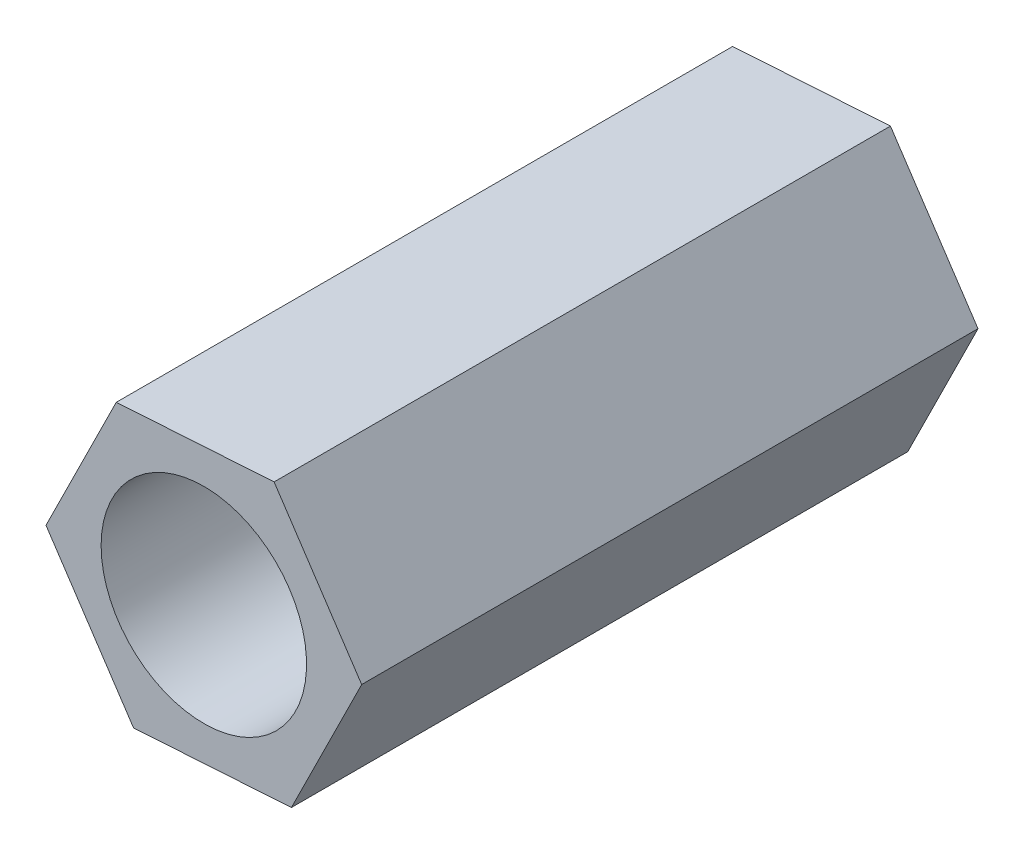
ISO-10303-21;
HEADER;
FILE_DESCRIPTION(('STEP AP214'),'2;1');
FILE_NAME('part.step','',(''),(''),'','','');
FILE_SCHEMA(('AUTOMOTIVE_DESIGN { 1 0 10303 214 1 1 1 1 }'));
ENDSEC;
DATA;
#1=APPLICATION_CONTEXT('core data for automotive mechanical design processes');
#2=APPLICATION_PROTOCOL_DEFINITION('international standard','automotive_design',2000,#1);
#3=PRODUCT_CONTEXT('',#1,'mechanical');
#4=PRODUCT('Part','Part','',(#3));
#5=PRODUCT_RELATED_PRODUCT_CATEGORY('part','',(#4));
#6=PRODUCT_DEFINITION_FORMATION('','',#4);
#7=PRODUCT_DEFINITION_CONTEXT('part definition',#1,'design');
#8=PRODUCT_DEFINITION('design','',#6,#7);
#9=PRODUCT_DEFINITION_SHAPE('','',#8);
#10=(LENGTH_UNIT() NAMED_UNIT(*) SI_UNIT(.MILLI.,.METRE.));
#11=(NAMED_UNIT(*) PLANE_ANGLE_UNIT() SI_UNIT($,.RADIAN.));
#12=(NAMED_UNIT(*) SI_UNIT($,.STERADIAN.) SOLID_ANGLE_UNIT());
#13=UNCERTAINTY_MEASURE_WITH_UNIT(LENGTH_MEASURE(1.E-05),#10,'distance_accuracy_value','');
#14=(GEOMETRIC_REPRESENTATION_CONTEXT(3) GLOBAL_UNCERTAINTY_ASSIGNED_CONTEXT((#13)) GLOBAL_UNIT_ASSIGNED_CONTEXT((#10,
#11,#12)) REPRESENTATION_CONTEXT('',''));
#15=CARTESIAN_POINT('',(0.,0.,0.));
#16=DIRECTION('',(0.,0.,1.));
#17=DIRECTION('',(1.,0.,0.));
#18=AXIS2_PLACEMENT_3D('',#15,#16,#17);
#19=CARTESIAN_POINT('',(2.30480420030551,0.14563973217298,9.));
#20=DIRECTION('',(-0.832769648149025,-0.55361964661828,0.));
#21=DIRECTION('',(0.55361964661828,-0.832769648149025,0.));
#22=AXIS2_PLACEMENT_3D('',#19,#20,#21);
#23=PLANE('',#22);
#24=DIRECTION('',(-0.55361964661828,0.832769648149025,0.));
#25=VECTOR('',#24,1.);
#26=CARTESIAN_POINT('',(2.30480420030551,0.14563973217298,0.));
#27=LINE('',#26,#25);
#28=CARTESIAN_POINT('',(2.30480420030551,0.14563973217298,0.));
#29=VERTEX_POINT('',#28);
#30=CARTESIAN_POINT('',(1.02627439229059,2.06883885430014,0.));
#31=VERTEX_POINT('',#30);
#32=EDGE_CURVE('E128',#29,#31,#27,.T.);
#33=ORIENTED_EDGE('',*,*,#32,.T.);
#34=DIRECTION('',(0.,0.,-1.));
#35=VECTOR('',#34,1.);
#36=CARTESIAN_POINT('',(1.02627439229059,2.06883885430014,9.));
#37=LINE('',#36,#35);
#38=CARTESIAN_POINT('',(1.02627439229059,2.06883885430014,9.));
#39=VERTEX_POINT('',#38);
#40=EDGE_CURVE('E11',#39,#31,#37,.T.);
#41=ORIENTED_EDGE('',*,*,#40,.F.);
#42=DIRECTION('',(-0.55361964661828,0.832769648149025,0.));
#43=VECTOR('',#42,1.);
#44=CARTESIAN_POINT('',(2.30480420030551,0.14563973217298,9.));
#45=LINE('',#44,#43);
#46=CARTESIAN_POINT('',(2.30480420030551,0.14563973217298,9.));
#47=VERTEX_POINT('',#46);
#48=EDGE_CURVE('E145',#47,#39,#45,.T.);
#49=ORIENTED_EDGE('',*,*,#48,.F.);
#50=DIRECTION('',(0.,0.,-1.));
#51=VECTOR('',#50,1.);
#52=CARTESIAN_POINT('',(2.30480420030551,0.14563973217298,9.));
#53=LINE('',#52,#51);
#54=EDGE_CURVE('E124',#47,#29,#53,.T.);
#55=ORIENTED_EDGE('',*,*,#54,.T.);
#56=EDGE_LOOP('',(#33,#41,#49,#55));
#57=FACE_BOUND('',#56,.T.);
#58=ADVANCED_FACE('F39',(#57),#23,.F.);
#59=CARTESIAN_POINT('',(1.02627439229059,2.06883885430014,9.));
#60=DIRECTION('',(0.0630638539310811,-0.998009494106824,0.));
#61=DIRECTION('',(0.998009494106824,0.0630638539310811,0.));
#62=AXIS2_PLACEMENT_3D('',#59,#60,#61);
#63=PLANE('',#62);
#64=DIRECTION('',(-0.998009494106824,-0.0630638539310811,0.));
#65=VECTOR('',#64,1.);
#66=CARTESIAN_POINT('',(1.02627439229059,2.06883885430014,0.));
#67=LINE('',#66,#65);
#68=CARTESIAN_POINT('',(-1.27852980801492,1.92319912212716,0.));
#69=VERTEX_POINT('',#68);
#70=EDGE_CURVE('E132',#31,#69,#67,.T.);
#71=ORIENTED_EDGE('',*,*,#70,.T.);
#72=DIRECTION('',(0.,0.,-1.));
#73=VECTOR('',#72,1.);
#74=CARTESIAN_POINT('',(-1.27852980801492,1.92319912212716,9.));
#75=LINE('',#74,#73);
#76=CARTESIAN_POINT('',(-1.27852980801492,1.92319912212716,9.));
#77=VERTEX_POINT('',#76);
#78=EDGE_CURVE('E48',#77,#69,#75,.T.);
#79=ORIENTED_EDGE('',*,*,#78,.F.);
#80=DIRECTION('',(-0.998009494106824,-0.0630638539310811,0.));
#81=VECTOR('',#80,1.);
#82=CARTESIAN_POINT('',(1.02627439229059,2.06883885430014,9.));
#83=LINE('',#82,#81);
#84=EDGE_CURVE('E93',#39,#77,#83,.T.);
#85=ORIENTED_EDGE('',*,*,#84,.F.);
#86=ORIENTED_EDGE('',*,*,#40,.T.);
#87=EDGE_LOOP('',(#71,#79,#85,#86));
#88=FACE_BOUND('',#87,.T.);
#89=ADVANCED_FACE('F174',(#88),#63,.F.);
#90=CARTESIAN_POINT('',(-1.27852980801492,1.92319912212716,9.));
#91=DIRECTION('',(0.895833502080107,-0.444389847488544,0.));
#92=DIRECTION('',(0.444389847488544,0.895833502080107,0.));
#93=AXIS2_PLACEMENT_3D('',#90,#91,#92);
#94=PLANE('',#93);
#95=DIRECTION('',(-0.444389847488544,-0.895833502080107,0.));
#96=VECTOR('',#95,1.);
#97=CARTESIAN_POINT('',(-1.27852980801492,1.92319912212716,0.));
#98=LINE('',#97,#96);
#99=CARTESIAN_POINT('',(-2.30480420030551,-0.145639732172981,0.));
#100=VERTEX_POINT('',#99);
#101=EDGE_CURVE('E136',#69,#100,#98,.T.);
#102=ORIENTED_EDGE('',*,*,#101,.T.);
#103=DIRECTION('',(0.,0.,-1.));
#104=VECTOR('',#103,1.);
#105=CARTESIAN_POINT('',(-2.30480420030551,-0.145639732172981,9.));
#106=LINE('',#105,#104);
#107=CARTESIAN_POINT('',(-2.30480420030551,-0.145639732172981,9.));
#108=VERTEX_POINT('',#107);
#109=EDGE_CURVE('E117',#108,#100,#106,.T.);
#110=ORIENTED_EDGE('',*,*,#109,.F.);
#111=DIRECTION('',(-0.444389847488544,-0.895833502080107,0.));
#112=VECTOR('',#111,1.);
#113=CARTESIAN_POINT('',(-1.27852980801492,1.92319912212716,9.));
#114=LINE('',#113,#112);
#115=EDGE_CURVE('E106',#77,#108,#114,.T.);
#116=ORIENTED_EDGE('',*,*,#115,.F.);
#117=ORIENTED_EDGE('',*,*,#78,.T.);
#118=EDGE_LOOP('',(#102,#110,#116,#117));
#119=FACE_BOUND('',#118,.T.);
#120=ADVANCED_FACE('F155',(#119),#94,.F.);
#121=CARTESIAN_POINT('',(-2.30480420030551,-0.145639732172981,9.));
#122=DIRECTION('',(0.832769648149025,0.55361964661828,0.));
#123=DIRECTION('',(-0.55361964661828,0.832769648149025,0.));
#124=AXIS2_PLACEMENT_3D('',#121,#122,#123);
#125=PLANE('',#124);
#126=DIRECTION('',(0.55361964661828,-0.832769648149025,0.));
#127=VECTOR('',#126,1.);
#128=CARTESIAN_POINT('',(-2.30480420030551,-0.145639732172981,0.));
#129=LINE('',#128,#127);
#130=CARTESIAN_POINT('',(-1.02627439229059,-2.06883885430014,0.));
#131=VERTEX_POINT('',#130);
#132=EDGE_CURVE('E115',#100,#131,#129,.T.);
#133=ORIENTED_EDGE('',*,*,#132,.T.);
#134=DIRECTION('',(0.,0.,-1.));
#135=VECTOR('',#134,1.);
#136=CARTESIAN_POINT('',(-1.02627439229059,-2.06883885430014,9.));
#137=LINE('',#136,#135);
#138=CARTESIAN_POINT('',(-1.02627439229059,-2.06883885430014,9.));
#139=VERTEX_POINT('',#138);
#140=EDGE_CURVE('E112',#139,#131,#137,.T.);
#141=ORIENTED_EDGE('',*,*,#140,.F.);
#142=DIRECTION('',(0.55361964661828,-0.832769648149025,0.));
#143=VECTOR('',#142,1.);
#144=CARTESIAN_POINT('',(-2.30480420030551,-0.145639732172981,9.));
#145=LINE('',#144,#143);
#146=EDGE_CURVE('E100',#108,#139,#145,.T.);
#147=ORIENTED_EDGE('',*,*,#146,.F.);
#148=ORIENTED_EDGE('',*,*,#109,.T.);
#149=EDGE_LOOP('',(#133,#141,#147,#148));
#150=FACE_BOUND('',#149,.T.);
#151=ADVANCED_FACE('F113',(#150),#125,.F.);
#152=CARTESIAN_POINT('',(-1.02627439229059,-2.06883885430014,9.));
#153=DIRECTION('',(-0.0630638539310812,0.998009494106824,0.));
#154=DIRECTION('',(-0.998009494106824,-0.0630638539310812,0.));
#155=AXIS2_PLACEMENT_3D('',#152,#153,#154);
#156=PLANE('',#155);
#157=DIRECTION('',(0.998009494106824,0.0630638539310812,0.));
#158=VECTOR('',#157,1.);
#159=CARTESIAN_POINT('',(-1.02627439229059,-2.06883885430014,0.));
#160=LINE('',#159,#158);
#161=CARTESIAN_POINT('',(1.27852980801492,-1.92319912212716,0.));
#162=VERTEX_POINT('',#161);
#163=EDGE_CURVE('E79',#131,#162,#160,.T.);
#164=ORIENTED_EDGE('',*,*,#163,.T.);
#165=DIRECTION('',(0.,0.,-1.));
#166=VECTOR('',#165,1.);
#167=CARTESIAN_POINT('',(1.27852980801492,-1.92319912212716,9.));
#168=LINE('',#167,#166);
#169=CARTESIAN_POINT('',(1.27852980801492,-1.92319912212716,9.));
#170=VERTEX_POINT('',#169);
#171=EDGE_CURVE('E118',#170,#162,#168,.T.);
#172=ORIENTED_EDGE('',*,*,#171,.F.);
#173=DIRECTION('',(0.998009494106824,0.0630638539310812,0.));
#174=VECTOR('',#173,1.);
#175=CARTESIAN_POINT('',(-1.02627439229059,-2.06883885430014,9.));
#176=LINE('',#175,#174);
#177=EDGE_CURVE('E104',#139,#170,#176,.T.);
#178=ORIENTED_EDGE('',*,*,#177,.F.);
#179=ORIENTED_EDGE('',*,*,#140,.T.);
#180=EDGE_LOOP('',(#164,#172,#178,#179));
#181=FACE_BOUND('',#180,.T.);
#182=ADVANCED_FACE('F120',(#181),#156,.F.);
#183=CARTESIAN_POINT('',(1.27852980801492,-1.92319912212716,9.));
#184=DIRECTION('',(-0.895833502080106,0.444389847488544,0.));
#185=DIRECTION('',(-0.444389847488545,-0.895833502080107,0.));
#186=AXIS2_PLACEMENT_3D('',#183,#184,#185);
#187=PLANE('',#186);
#188=DIRECTION('',(0.444389847488544,0.895833502080107,0.));
#189=VECTOR('',#188,1.);
#190=CARTESIAN_POINT('',(1.27852980801492,-1.92319912212716,0.));
#191=LINE('',#190,#189);
#192=EDGE_CURVE('E85',#162,#29,#191,.T.);
#193=ORIENTED_EDGE('',*,*,#192,.T.);
#194=ORIENTED_EDGE('',*,*,#54,.F.);
#195=DIRECTION('',(0.444389847488544,0.895833502080107,0.));
#196=VECTOR('',#195,1.);
#197=CARTESIAN_POINT('',(1.27852980801492,-1.92319912212716,9.));
#198=LINE('',#197,#196);
#199=EDGE_CURVE('E56',#170,#47,#198,.T.);
#200=ORIENTED_EDGE('',*,*,#199,.F.);
#201=ORIENTED_EDGE('',*,*,#171,.T.);
#202=EDGE_LOOP('',(#193,#194,#200,#201));
#203=FACE_BOUND('',#202,.T.);
#204=ADVANCED_FACE('F162',(#203),#187,.F.);
#205=CARTESIAN_POINT('',(0.,0.,9.));
#206=DIRECTION('',(0.,0.,1.));
#207=DIRECTION('',(1.,0.,0.));
#208=AXIS2_PLACEMENT_3D('',#205,#206,#207);
#209=PLANE('',#208);
#210=CARTESIAN_POINT('',(0.,0.,9.));
#211=DIRECTION('',(0.,0.,-1.));
#212=DIRECTION('',(-1.,0.,0.));
#213=AXIS2_PLACEMENT_3D('',#210,#211,#212);
#214=CIRCLE('',#213,1.5);
#215=CARTESIAN_POINT('',(-1.5,0.,9.));
#216=VERTEX_POINT('',#215);
#217=EDGE_CURVE('E133',#216,#216,#214,.T.);
#218=ORIENTED_EDGE('',*,*,#217,.T.);
#219=EDGE_LOOP('',(#218));
#220=FACE_BOUND('',#219,.T.);
#221=ORIENTED_EDGE('',*,*,#48,.T.);
#222=ORIENTED_EDGE('',*,*,#84,.T.);
#223=ORIENTED_EDGE('',*,*,#115,.T.);
#224=ORIENTED_EDGE('',*,*,#146,.T.);
#225=ORIENTED_EDGE('',*,*,#177,.T.);
#226=ORIENTED_EDGE('',*,*,#199,.T.);
#227=EDGE_LOOP('',(#221,#222,#223,#224,#225,#226));
#228=FACE_BOUND('',#227,.T.);
#229=ADVANCED_FACE('F102',(#220,#228),#209,.T.);
#230=CARTESIAN_POINT('',(0.,0.,0.));
#231=DIRECTION('',(0.,0.,1.));
#232=DIRECTION('',(1.,0.,0.));
#233=AXIS2_PLACEMENT_3D('',#230,#231,#232);
#234=PLANE('',#233);
#235=CARTESIAN_POINT('',(0.,0.,0.));
#236=DIRECTION('',(0.,0.,-1.));
#237=DIRECTION('',(-1.,0.,0.));
#238=AXIS2_PLACEMENT_3D('',#235,#236,#237);
#239=CIRCLE('',#238,1.5);
#240=CARTESIAN_POINT('',(-1.5,0.,0.));
#241=VERTEX_POINT('',#240);
#242=EDGE_CURVE('E229',#241,#241,#239,.T.);
#243=ORIENTED_EDGE('',*,*,#242,.F.);
#244=EDGE_LOOP('',(#243));
#245=FACE_BOUND('',#244,.T.);
#246=ORIENTED_EDGE('',*,*,#32,.F.);
#247=ORIENTED_EDGE('',*,*,#192,.F.);
#248=ORIENTED_EDGE('',*,*,#163,.F.);
#249=ORIENTED_EDGE('',*,*,#132,.F.);
#250=ORIENTED_EDGE('',*,*,#101,.F.);
#251=ORIENTED_EDGE('',*,*,#70,.F.);
#252=EDGE_LOOP('',(#246,#247,#248,#249,#250,#251));
#253=FACE_BOUND('',#252,.T.);
#254=ADVANCED_FACE('F158',(#245,#253),#234,.F.);
#255=CARTESIAN_POINT('',(0.,0.,9.));
#256=DIRECTION('',(0.,0.,-1.));
#257=DIRECTION('',(-1.,0.,0.));
#258=AXIS2_PLACEMENT_3D('',#255,#256,#257);
#259=CYLINDRICAL_SURFACE('',#258,1.5);
#260=ORIENTED_EDGE('',*,*,#217,.F.);
#261=EDGE_LOOP('',(#260));
#262=FACE_BOUND('',#261,.T.);
#263=ORIENTED_EDGE('',*,*,#242,.T.);
#264=EDGE_LOOP('',(#263));
#265=FACE_BOUND('',#264,.T.);
#266=ADVANCED_FACE('F211',(#262,#265),#259,.F.);
#267=CLOSED_SHELL('',(#58,#89,#120,#151,#182,#204,#229,#254,#266));
#268=MANIFOLD_SOLID_BREP('B2',#267);
#269=ADVANCED_BREP_SHAPE_REPRESENTATION('',(#18,#268),#14);
#270=SHAPE_DEFINITION_REPRESENTATION(#9,#269);
ENDSEC;
END-ISO-10303-21;
